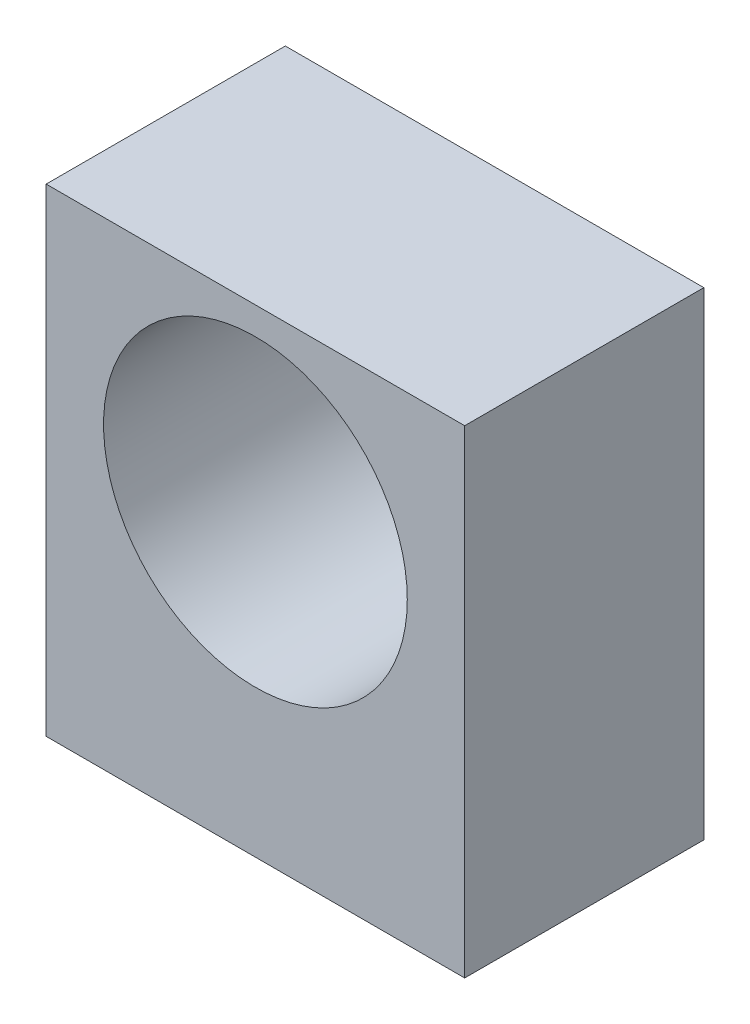
ISO-10303-21;
HEADER;
FILE_DESCRIPTION(('STEP AP214'),'2;1');
FILE_NAME('part.step','',(''),(''),'','','');
FILE_SCHEMA(('AUTOMOTIVE_DESIGN { 1 0 10303 214 1 1 1 1 }'));
ENDSEC;
DATA;
#1=APPLICATION_CONTEXT('core data for automotive mechanical design processes');
#2=APPLICATION_PROTOCOL_DEFINITION('international standard','automotive_design',2000,#1);
#3=PRODUCT_CONTEXT('',#1,'mechanical');
#4=PRODUCT('Part','Part','',(#3));
#5=PRODUCT_RELATED_PRODUCT_CATEGORY('part','',(#4));
#6=PRODUCT_DEFINITION_FORMATION('','',#4);
#7=PRODUCT_DEFINITION_CONTEXT('part definition',#1,'design');
#8=PRODUCT_DEFINITION('design','',#6,#7);
#9=PRODUCT_DEFINITION_SHAPE('','',#8);
#10=(LENGTH_UNIT() NAMED_UNIT(*) SI_UNIT(.MILLI.,.METRE.));
#11=(NAMED_UNIT(*) PLANE_ANGLE_UNIT() SI_UNIT($,.RADIAN.));
#12=(NAMED_UNIT(*) SI_UNIT($,.STERADIAN.) SOLID_ANGLE_UNIT());
#13=UNCERTAINTY_MEASURE_WITH_UNIT(LENGTH_MEASURE(1.E-05),#10,'distance_accuracy_value','');
#14=(GEOMETRIC_REPRESENTATION_CONTEXT(3) GLOBAL_UNCERTAINTY_ASSIGNED_CONTEXT((#13)) GLOBAL_UNIT_ASSIGNED_CONTEXT((#10,
#11,#12)) REPRESENTATION_CONTEXT('',''));
#15=CARTESIAN_POINT('',(0.,0.,0.));
#16=DIRECTION('',(0.,0.,1.));
#17=DIRECTION('',(1.,0.,0.));
#18=AXIS2_PLACEMENT_3D('',#15,#16,#17);
#19=CARTESIAN_POINT('',(-16.3353241489162,40.,-9.14482917573461));
#20=DIRECTION('',(1.,0.,0.));
#21=DIRECTION('',(0.,0.,-1.));
#22=AXIS2_PLACEMENT_3D('',#19,#20,#21);
#23=PLANE('',#22);
#24=DIRECTION('',(0.,0.,1.));
#25=VECTOR('',#24,1.);
#26=CARTESIAN_POINT('',(-16.3353241489162,0.,-9.14482917573461));
#27=LINE('',#26,#25);
#28=CARTESIAN_POINT('',(-16.3353241489162,0.,-9.14482917573461));
#29=VERTEX_POINT('',#28);
#30=CARTESIAN_POINT('',(-16.3353241489162,0.,10.8551708242654));
#31=VERTEX_POINT('',#30);
#32=EDGE_CURVE('E96',#29,#31,#27,.T.);
#33=ORIENTED_EDGE('',*,*,#32,.T.);
#34=DIRECTION('',(0.,-1.,0.));
#35=VECTOR('',#34,1.);
#36=CARTESIAN_POINT('',(-16.3353241489162,40.,10.8551708242654));
#37=LINE('',#36,#35);
#38=CARTESIAN_POINT('',(-16.3353241489162,40.,10.8551708242654));
#39=VERTEX_POINT('',#38);
#40=EDGE_CURVE('E11',#39,#31,#37,.T.);
#41=ORIENTED_EDGE('',*,*,#40,.F.);
#42=DIRECTION('',(0.,0.,1.));
#43=VECTOR('',#42,1.);
#44=CARTESIAN_POINT('',(-16.3353241489162,40.,-9.14482917573461));
#45=LINE('',#44,#43);
#46=CARTESIAN_POINT('',(-16.3353241489162,40.,-9.14482917573461));
#47=VERTEX_POINT('',#46);
#48=EDGE_CURVE('E84',#47,#39,#45,.T.);
#49=ORIENTED_EDGE('',*,*,#48,.F.);
#50=DIRECTION('',(0.,-1.,0.));
#51=VECTOR('',#50,1.);
#52=CARTESIAN_POINT('',(-16.3353241489162,40.,-9.14482917573461));
#53=LINE('',#52,#51);
#54=EDGE_CURVE('E92',#47,#29,#53,.T.);
#55=ORIENTED_EDGE('',*,*,#54,.T.);
#56=EDGE_LOOP('',(#33,#41,#49,#55));
#57=FACE_BOUND('',#56,.T.);
#58=ADVANCED_FACE('F33',(#57),#23,.F.);
#59=CARTESIAN_POINT('',(-16.3353241489162,40.,10.8551708242654));
#60=DIRECTION('',(0.,0.,-1.));
#61=DIRECTION('',(-1.,0.,0.));
#62=AXIS2_PLACEMENT_3D('',#59,#60,#61);
#63=PLANE('',#62);
#64=CARTESIAN_POINT('',(1.16467585108376,25.,10.8551708242654));
#65=DIRECTION('',(0.,0.,1.));
#66=DIRECTION('',(1.,0.,0.));
#67=AXIS2_PLACEMENT_3D('',#64,#65,#66);
#68=CIRCLE('',#67,12.7);
#69=CARTESIAN_POINT('',(13.8646758510838,25.,10.8551708242654));
#70=VERTEX_POINT('',#69);
#71=EDGE_CURVE('E110',#70,#70,#68,.T.);
#72=ORIENTED_EDGE('',*,*,#71,.F.);
#73=EDGE_LOOP('',(#72));
#74=FACE_BOUND('',#73,.T.);
#75=DIRECTION('',(1.,0.,0.));
#76=VECTOR('',#75,1.);
#77=CARTESIAN_POINT('',(-16.3353241489162,0.,10.8551708242654));
#78=LINE('',#77,#76);
#79=CARTESIAN_POINT('',(18.6646758510838,0.,10.8551708242654));
#80=VERTEX_POINT('',#79);
#81=EDGE_CURVE('E88',#31,#80,#78,.T.);
#82=ORIENTED_EDGE('',*,*,#81,.T.);
#83=DIRECTION('',(0.,-1.,0.));
#84=VECTOR('',#83,1.);
#85=CARTESIAN_POINT('',(18.6646758510838,40.,10.8551708242654));
#86=LINE('',#85,#84);
#87=CARTESIAN_POINT('',(18.6646758510838,40.,10.8551708242654));
#88=VERTEX_POINT('',#87);
#89=EDGE_CURVE('E41',#88,#80,#86,.T.);
#90=ORIENTED_EDGE('',*,*,#89,.F.);
#91=DIRECTION('',(1.,0.,0.));
#92=VECTOR('',#91,1.);
#93=CARTESIAN_POINT('',(-16.3353241489162,40.,10.8551708242654));
#94=LINE('',#93,#92);
#95=EDGE_CURVE('E79',#39,#88,#94,.T.);
#96=ORIENTED_EDGE('',*,*,#95,.F.);
#97=ORIENTED_EDGE('',*,*,#40,.T.);
#98=EDGE_LOOP('',(#82,#90,#96,#97));
#99=FACE_BOUND('',#98,.T.);
#100=ADVANCED_FACE('F87',(#74,#99),#63,.F.);
#101=CARTESIAN_POINT('',(18.6646758510838,40.,-9.14482917573461));
#102=DIRECTION('',(-1.,0.,0.));
#103=DIRECTION('',(0.,0.,1.));
#104=AXIS2_PLACEMENT_3D('',#101,#102,#103);
#105=PLANE('',#104);
#106=DIRECTION('',(0.,0.,-1.));
#107=VECTOR('',#106,1.);
#108=CARTESIAN_POINT('',(18.6646758510838,0.,-9.14482917573461));
#109=LINE('',#108,#107);
#110=CARTESIAN_POINT('',(18.6646758510838,0.,-9.14482917573461));
#111=VERTEX_POINT('',#110);
#112=EDGE_CURVE('E66',#80,#111,#109,.T.);
#113=ORIENTED_EDGE('',*,*,#112,.T.);
#114=DIRECTION('',(0.,-1.,0.));
#115=VECTOR('',#114,1.);
#116=CARTESIAN_POINT('',(18.6646758510838,40.,-9.14482917573461));
#117=LINE('',#116,#115);
#118=CARTESIAN_POINT('',(18.6646758510838,40.,-9.14482917573461));
#119=VERTEX_POINT('',#118);
#120=EDGE_CURVE('E89',#119,#111,#117,.T.);
#121=ORIENTED_EDGE('',*,*,#120,.F.);
#122=DIRECTION('',(0.,0.,-1.));
#123=VECTOR('',#122,1.);
#124=CARTESIAN_POINT('',(18.6646758510838,40.,-9.14482917573461));
#125=LINE('',#124,#123);
#126=EDGE_CURVE('E82',#88,#119,#125,.T.);
#127=ORIENTED_EDGE('',*,*,#126,.F.);
#128=ORIENTED_EDGE('',*,*,#89,.T.);
#129=EDGE_LOOP('',(#113,#121,#127,#128));
#130=FACE_BOUND('',#129,.T.);
#131=ADVANCED_FACE('F90',(#130),#105,.F.);
#132=CARTESIAN_POINT('',(-16.3353241489162,40.,-9.14482917573461));
#133=DIRECTION('',(0.,0.,1.));
#134=DIRECTION('',(1.,0.,0.));
#135=AXIS2_PLACEMENT_3D('',#132,#133,#134);
#136=PLANE('',#135);
#137=CARTESIAN_POINT('',(1.16467585108376,25.,-9.14482917573461));
#138=DIRECTION('',(0.,0.,1.));
#139=DIRECTION('',(1.,0.,0.));
#140=AXIS2_PLACEMENT_3D('',#137,#138,#139);
#141=CIRCLE('',#140,12.7);
#142=CARTESIAN_POINT('',(13.8646758510838,25.,-9.14482917573461));
#143=VERTEX_POINT('',#142);
#144=EDGE_CURVE('E99',#143,#143,#141,.T.);
#145=ORIENTED_EDGE('',*,*,#144,.T.);
#146=EDGE_LOOP('',(#145));
#147=FACE_BOUND('',#146,.T.);
#148=DIRECTION('',(-1.,0.,0.));
#149=VECTOR('',#148,1.);
#150=CARTESIAN_POINT('',(-16.3353241489162,0.,-9.14482917573461));
#151=LINE('',#150,#149);
#152=EDGE_CURVE('E72',#111,#29,#151,.T.);
#153=ORIENTED_EDGE('',*,*,#152,.T.);
#154=ORIENTED_EDGE('',*,*,#54,.F.);
#155=DIRECTION('',(-1.,0.,0.));
#156=VECTOR('',#155,1.);
#157=CARTESIAN_POINT('',(-16.3353241489162,40.,-9.14482917573461));
#158=LINE('',#157,#156);
#159=EDGE_CURVE('E49',#119,#47,#158,.T.);
#160=ORIENTED_EDGE('',*,*,#159,.F.);
#161=ORIENTED_EDGE('',*,*,#120,.T.);
#162=EDGE_LOOP('',(#153,#154,#160,#161));
#163=FACE_BOUND('',#162,.T.);
#164=ADVANCED_FACE('F104',(#147,#163),#136,.F.);
#165=CARTESIAN_POINT('',(0.,40.,0.));
#166=DIRECTION('',(0.,1.,0.));
#167=DIRECTION('',(0.,0.,1.));
#168=AXIS2_PLACEMENT_3D('',#165,#166,#167);
#169=PLANE('',#168);
#170=ORIENTED_EDGE('',*,*,#48,.T.);
#171=ORIENTED_EDGE('',*,*,#95,.T.);
#172=ORIENTED_EDGE('',*,*,#126,.T.);
#173=ORIENTED_EDGE('',*,*,#159,.T.);
#174=EDGE_LOOP('',(#170,#171,#172,#173));
#175=FACE_BOUND('',#174,.T.);
#176=ADVANCED_FACE('F80',(#175),#169,.T.);
#177=CARTESIAN_POINT('',(0.,0.,0.));
#178=DIRECTION('',(0.,1.,0.));
#179=DIRECTION('',(0.,0.,1.));
#180=AXIS2_PLACEMENT_3D('',#177,#178,#179);
#181=PLANE('',#180);
#182=CARTESIAN_POINT('',(10.6646758510838,0.,0.855170824265387));
#183=DIRECTION('',(0.,-1.,0.));
#184=DIRECTION('',(0.,0.,-1.));
#185=AXIS2_PLACEMENT_3D('',#182,#183,#184);
#186=CIRCLE('',#185,1.75);
#187=CARTESIAN_POINT('',(10.6646758510838,0.,-0.894829175734613));
#188=VERTEX_POINT('',#187);
#189=EDGE_CURVE('E122',#188,#188,#186,.T.);
#190=ORIENTED_EDGE('',*,*,#189,.F.);
#191=EDGE_LOOP('',(#190));
#192=FACE_BOUND('',#191,.T.);
#193=CARTESIAN_POINT('',(-8.33532414891625,0.,0.855170824265387));
#194=DIRECTION('',(0.,-1.,0.));
#195=DIRECTION('',(0.,0.,-1.));
#196=AXIS2_PLACEMENT_3D('',#193,#194,#195);
#197=CIRCLE('',#196,1.75);
#198=CARTESIAN_POINT('',(-8.33532414891625,0.,-0.894829175734613));
#199=VERTEX_POINT('',#198);
#200=EDGE_CURVE('E116',#199,#199,#197,.T.);
#201=ORIENTED_EDGE('',*,*,#200,.F.);
#202=EDGE_LOOP('',(#201));
#203=FACE_BOUND('',#202,.T.);
#204=ORIENTED_EDGE('',*,*,#32,.F.);
#205=ORIENTED_EDGE('',*,*,#152,.F.);
#206=ORIENTED_EDGE('',*,*,#112,.F.);
#207=ORIENTED_EDGE('',*,*,#81,.F.);
#208=EDGE_LOOP('',(#204,#205,#206,#207));
#209=FACE_BOUND('',#208,.T.);
#210=ADVANCED_FACE('F107',(#192,#203,#209),#181,.F.);
#211=CARTESIAN_POINT('',(1.16467585108376,25.,-9.14482917573461));
#212=DIRECTION('',(0.,0.,1.));
#213=DIRECTION('',(1.,0.,0.));
#214=AXIS2_PLACEMENT_3D('',#211,#212,#213);
#215=CYLINDRICAL_SURFACE('',#214,12.7);
#216=ORIENTED_EDGE('',*,*,#144,.F.);
#217=EDGE_LOOP('',(#216));
#218=FACE_BOUND('',#217,.T.);
#219=ORIENTED_EDGE('',*,*,#71,.T.);
#220=EDGE_LOOP('',(#219));
#221=FACE_BOUND('',#220,.T.);
#222=ADVANCED_FACE('F139',(#218,#221),#215,.F.);
#223=CARTESIAN_POINT('',(-8.33532414891625,10.,0.855170824265387));
#224=DIRECTION('',(0.,-1.,0.));
#225=DIRECTION('',(0.,0.,-1.));
#226=AXIS2_PLACEMENT_3D('',#223,#224,#225);
#227=CYLINDRICAL_SURFACE('',#226,1.75);
#228=CARTESIAN_POINT('',(-8.33532414891625,10.,0.855170824265387));
#229=DIRECTION('',(0.,-1.,0.));
#230=DIRECTION('',(0.,0.,-1.));
#231=AXIS2_PLACEMENT_3D('',#228,#229,#230);
#232=CIRCLE('',#231,1.75);
#233=CARTESIAN_POINT('',(-8.33532414891625,10.,-0.894829175734613));
#234=VERTEX_POINT('',#233);
#235=EDGE_CURVE('E113',#234,#234,#232,.T.);
#236=ORIENTED_EDGE('',*,*,#235,.F.);
#237=EDGE_LOOP('',(#236));
#238=FACE_BOUND('',#237,.T.);
#239=ORIENTED_EDGE('',*,*,#200,.T.);
#240=EDGE_LOOP('',(#239));
#241=FACE_BOUND('',#240,.T.);
#242=ADVANCED_FACE('F143',(#238,#241),#227,.F.);
#243=CARTESIAN_POINT('',(-8.33532414891625,10.,0.855170824265387));
#244=DIRECTION('',(0.,-1.,0.));
#245=DIRECTION('',(0.,0.,-1.));
#246=AXIS2_PLACEMENT_3D('',#243,#244,#245);
#247=PLANE('',#246);
#248=ORIENTED_EDGE('',*,*,#235,.T.);
#249=EDGE_LOOP('',(#248));
#250=FACE_BOUND('',#249,.T.);
#251=ADVANCED_FACE('F133',(#250),#247,.T.);
#252=CARTESIAN_POINT('',(10.6646758510838,10.,0.855170824265387));
#253=DIRECTION('',(0.,-1.,0.));
#254=DIRECTION('',(0.,0.,-1.));
#255=AXIS2_PLACEMENT_3D('',#252,#253,#254);
#256=CYLINDRICAL_SURFACE('',#255,1.75);
#257=CARTESIAN_POINT('',(10.6646758510838,10.,0.855170824265387));
#258=DIRECTION('',(0.,-1.,0.));
#259=DIRECTION('',(0.,0.,-1.));
#260=AXIS2_PLACEMENT_3D('',#257,#258,#259);
#261=CIRCLE('',#260,1.75);
#262=CARTESIAN_POINT('',(10.6646758510838,10.,-0.894829175734613));
#263=VERTEX_POINT('',#262);
#264=EDGE_CURVE('E119',#263,#263,#261,.T.);
#265=ORIENTED_EDGE('',*,*,#264,.F.);
#266=EDGE_LOOP('',(#265));
#267=FACE_BOUND('',#266,.T.);
#268=ORIENTED_EDGE('',*,*,#189,.T.);
#269=EDGE_LOOP('',(#268));
#270=FACE_BOUND('',#269,.T.);
#271=ADVANCED_FACE('F130',(#267,#270),#256,.F.);
#272=CARTESIAN_POINT('',(10.6646758510838,10.,0.855170824265387));
#273=DIRECTION('',(0.,-1.,0.));
#274=DIRECTION('',(0.,0.,-1.));
#275=AXIS2_PLACEMENT_3D('',#272,#273,#274);
#276=PLANE('',#275);
#277=ORIENTED_EDGE('',*,*,#264,.T.);
#278=EDGE_LOOP('',(#277));
#279=FACE_BOUND('',#278,.T.);
#280=ADVANCED_FACE('F128',(#279),#276,.T.);
#281=CLOSED_SHELL('',(#58,#100,#131,#164,#176,#210,#222,#242,#251,#271,#280));
#282=MANIFOLD_SOLID_BREP('B2',#281);
#283=ADVANCED_BREP_SHAPE_REPRESENTATION('',(#18,#282),#14);
#284=SHAPE_DEFINITION_REPRESENTATION(#9,#283);
ENDSEC;
END-ISO-10303-21;
